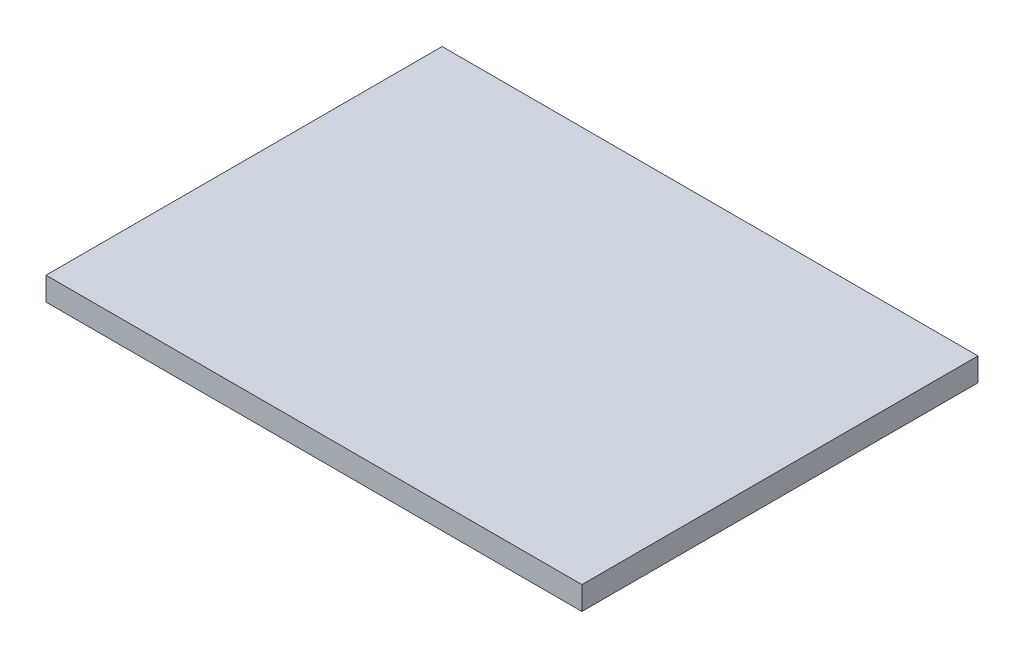
ISO-10303-21;
HEADER;
FILE_DESCRIPTION(('STEP AP214'),'2;1');
FILE_NAME('part.step','',(''),(''),'','','');
FILE_SCHEMA(('AUTOMOTIVE_DESIGN { 1 0 10303 214 1 1 1 1 }'));
ENDSEC;
DATA;
#1=APPLICATION_CONTEXT('core data for automotive mechanical design processes');
#2=APPLICATION_PROTOCOL_DEFINITION('international standard','automotive_design',2000,#1);
#3=PRODUCT_CONTEXT('',#1,'mechanical');
#4=PRODUCT('Part','Part','',(#3));
#5=PRODUCT_RELATED_PRODUCT_CATEGORY('part','',(#4));
#6=PRODUCT_DEFINITION_FORMATION('','',#4);
#7=PRODUCT_DEFINITION_CONTEXT('part definition',#1,'design');
#8=PRODUCT_DEFINITION('design','',#6,#7);
#9=PRODUCT_DEFINITION_SHAPE('','',#8);
#10=(LENGTH_UNIT() NAMED_UNIT(*) SI_UNIT(.MILLI.,.METRE.));
#11=(NAMED_UNIT(*) PLANE_ANGLE_UNIT() SI_UNIT($,.RADIAN.));
#12=(NAMED_UNIT(*) SI_UNIT($,.STERADIAN.) SOLID_ANGLE_UNIT());
#13=UNCERTAINTY_MEASURE_WITH_UNIT(LENGTH_MEASURE(1.E-05),#10,'distance_accuracy_value','');
#14=(GEOMETRIC_REPRESENTATION_CONTEXT(3) GLOBAL_UNCERTAINTY_ASSIGNED_CONTEXT((#13)) GLOBAL_UNIT_ASSIGNED_CONTEXT((#10,
#11,#12)) REPRESENTATION_CONTEXT('',''));
#15=CARTESIAN_POINT('',(0.,0.,0.));
#16=DIRECTION('',(0.,0.,1.));
#17=DIRECTION('',(1.,0.,0.));
#18=AXIS2_PLACEMENT_3D('',#15,#16,#17);
#19=CARTESIAN_POINT('',(0.,2.,0.));
#20=DIRECTION('',(1.,0.,0.));
#21=DIRECTION('',(0.,0.,-1.));
#22=AXIS2_PLACEMENT_3D('',#19,#20,#21);
#23=PLANE('',#22);
#24=DIRECTION('',(0.,0.,1.));
#25=VECTOR('',#24,1.);
#26=CARTESIAN_POINT('',(0.,0.,0.));
#27=LINE('',#26,#25);
#28=CARTESIAN_POINT('',(0.,0.,-34.));
#29=VERTEX_POINT('',#28);
#30=CARTESIAN_POINT('',(0.,0.,0.));
#31=VERTEX_POINT('',#30);
#32=EDGE_CURVE('E104',#29,#31,#27,.T.);
#33=ORIENTED_EDGE('',*,*,#32,.T.);
#34=DIRECTION('',(0.,-1.,0.));
#35=VECTOR('',#34,1.);
#36=CARTESIAN_POINT('',(0.,2.,0.));
#37=LINE('',#36,#35);
#38=CARTESIAN_POINT('',(0.,2.,0.));
#39=VERTEX_POINT('',#38);
#40=EDGE_CURVE('E11',#39,#31,#37,.T.);
#41=ORIENTED_EDGE('',*,*,#40,.F.);
#42=DIRECTION('',(0.,0.,1.));
#43=VECTOR('',#42,1.);
#44=CARTESIAN_POINT('',(0.,2.,0.));
#45=LINE('',#44,#43);
#46=CARTESIAN_POINT('',(0.,2.,-34.));
#47=VERTEX_POINT('',#46);
#48=EDGE_CURVE('E92',#47,#39,#45,.T.);
#49=ORIENTED_EDGE('',*,*,#48,.F.);
#50=DIRECTION('',(0.,-1.,0.));
#51=VECTOR('',#50,1.);
#52=CARTESIAN_POINT('',(0.,2.,-34.));
#53=LINE('',#52,#51);
#54=EDGE_CURVE('E100',#47,#29,#53,.T.);
#55=ORIENTED_EDGE('',*,*,#54,.T.);
#56=EDGE_LOOP('',(#33,#41,#49,#55));
#57=FACE_BOUND('',#56,.T.);
#58=ADVANCED_FACE('F41',(#57),#23,.F.);
#59=CARTESIAN_POINT('',(0.,2.,0.));
#60=DIRECTION('',(0.,0.,-1.));
#61=DIRECTION('',(-1.,0.,0.));
#62=AXIS2_PLACEMENT_3D('',#59,#60,#61);
#63=PLANE('',#62);
#64=DIRECTION('',(1.,0.,0.));
#65=VECTOR('',#64,1.);
#66=CARTESIAN_POINT('',(0.,0.,0.));
#67=LINE('',#66,#65);
#68=CARTESIAN_POINT('',(46.,0.,0.));
#69=VERTEX_POINT('',#68);
#70=EDGE_CURVE('E96',#31,#69,#67,.T.);
#71=ORIENTED_EDGE('',*,*,#70,.T.);
#72=DIRECTION('',(0.,-1.,0.));
#73=VECTOR('',#72,1.);
#74=CARTESIAN_POINT('',(46.,2.,0.));
#75=LINE('',#74,#73);
#76=CARTESIAN_POINT('',(46.,2.,0.));
#77=VERTEX_POINT('',#76);
#78=EDGE_CURVE('E49',#77,#69,#75,.T.);
#79=ORIENTED_EDGE('',*,*,#78,.F.);
#80=DIRECTION('',(1.,0.,0.));
#81=VECTOR('',#80,1.);
#82=CARTESIAN_POINT('',(0.,2.,0.));
#83=LINE('',#82,#81);
#84=EDGE_CURVE('E87',#39,#77,#83,.T.);
#85=ORIENTED_EDGE('',*,*,#84,.F.);
#86=ORIENTED_EDGE('',*,*,#40,.T.);
#87=EDGE_LOOP('',(#71,#79,#85,#86));
#88=FACE_BOUND('',#87,.T.);
#89=ADVANCED_FACE('F95',(#88),#63,.F.);
#90=CARTESIAN_POINT('',(46.,2.,0.));
#91=DIRECTION('',(-1.,0.,0.));
#92=DIRECTION('',(0.,0.,1.));
#93=AXIS2_PLACEMENT_3D('',#90,#91,#92);
#94=PLANE('',#93);
#95=DIRECTION('',(0.,0.,-1.));
#96=VECTOR('',#95,1.);
#97=CARTESIAN_POINT('',(46.,0.,0.));
#98=LINE('',#97,#96);
#99=CARTESIAN_POINT('',(46.,0.,-34.));
#100=VERTEX_POINT('',#99);
#101=EDGE_CURVE('E74',#69,#100,#98,.T.);
#102=ORIENTED_EDGE('',*,*,#101,.T.);
#103=DIRECTION('',(0.,-1.,0.));
#104=VECTOR('',#103,1.);
#105=CARTESIAN_POINT('',(46.,2.,-34.));
#106=LINE('',#105,#104);
#107=CARTESIAN_POINT('',(46.,2.,-34.));
#108=VERTEX_POINT('',#107);
#109=EDGE_CURVE('E97',#108,#100,#106,.T.);
#110=ORIENTED_EDGE('',*,*,#109,.F.);
#111=DIRECTION('',(0.,0.,-1.));
#112=VECTOR('',#111,1.);
#113=CARTESIAN_POINT('',(46.,2.,0.));
#114=LINE('',#113,#112);
#115=EDGE_CURVE('E90',#77,#108,#114,.T.);
#116=ORIENTED_EDGE('',*,*,#115,.F.);
#117=ORIENTED_EDGE('',*,*,#78,.T.);
#118=EDGE_LOOP('',(#102,#110,#116,#117));
#119=FACE_BOUND('',#118,.T.);
#120=ADVANCED_FACE('F98',(#119),#94,.F.);
#121=CARTESIAN_POINT('',(0.,2.,-34.));
#122=DIRECTION('',(0.,0.,1.));
#123=DIRECTION('',(1.,0.,0.));
#124=AXIS2_PLACEMENT_3D('',#121,#122,#123);
#125=PLANE('',#124);
#126=DIRECTION('',(-1.,0.,0.));
#127=VECTOR('',#126,1.);
#128=CARTESIAN_POINT('',(0.,0.,-34.));
#129=LINE('',#128,#127);
#130=EDGE_CURVE('E80',#100,#29,#129,.T.);
#131=ORIENTED_EDGE('',*,*,#130,.T.);
#132=ORIENTED_EDGE('',*,*,#54,.F.);
#133=DIRECTION('',(-1.,0.,0.));
#134=VECTOR('',#133,1.);
#135=CARTESIAN_POINT('',(0.,2.,-34.));
#136=LINE('',#135,#134);
#137=EDGE_CURVE('E57',#108,#47,#136,.T.);
#138=ORIENTED_EDGE('',*,*,#137,.F.);
#139=ORIENTED_EDGE('',*,*,#109,.T.);
#140=EDGE_LOOP('',(#131,#132,#138,#139));
#141=FACE_BOUND('',#140,.T.);
#142=ADVANCED_FACE('F111',(#141),#125,.F.);
#143=CARTESIAN_POINT('',(0.,2.,0.));
#144=DIRECTION('',(0.,-1.,0.));
#145=DIRECTION('',(0.,0.,-1.));
#146=AXIS2_PLACEMENT_3D('',#143,#144,#145);
#147=PLANE('',#146);
#148=ORIENTED_EDGE('',*,*,#48,.T.);
#149=ORIENTED_EDGE('',*,*,#84,.T.);
#150=ORIENTED_EDGE('',*,*,#115,.T.);
#151=ORIENTED_EDGE('',*,*,#137,.T.);
#152=EDGE_LOOP('',(#148,#149,#150,#151));
#153=FACE_BOUND('',#152,.T.);
#154=ADVANCED_FACE('F88',(#153),#147,.F.);
#155=CARTESIAN_POINT('',(0.,0.,0.));
#156=DIRECTION('',(0.,-1.,0.));
#157=DIRECTION('',(0.,0.,-1.));
#158=AXIS2_PLACEMENT_3D('',#155,#156,#157);
#159=PLANE('',#158);
#160=ORIENTED_EDGE('',*,*,#32,.F.);
#161=ORIENTED_EDGE('',*,*,#130,.F.);
#162=ORIENTED_EDGE('',*,*,#101,.F.);
#163=ORIENTED_EDGE('',*,*,#70,.F.);
#164=EDGE_LOOP('',(#160,#161,#162,#163));
#165=FACE_BOUND('',#164,.T.);
#166=ADVANCED_FACE('F114',(#165),#159,.T.);
#167=CLOSED_SHELL('',(#58,#89,#120,#142,#154,#166));
#168=MANIFOLD_SOLID_BREP('B2',#167);
#169=ADVANCED_BREP_SHAPE_REPRESENTATION('',(#18,#168),#14);
#170=SHAPE_DEFINITION_REPRESENTATION(#9,#169);
ENDSEC;
END-ISO-10303-21;
